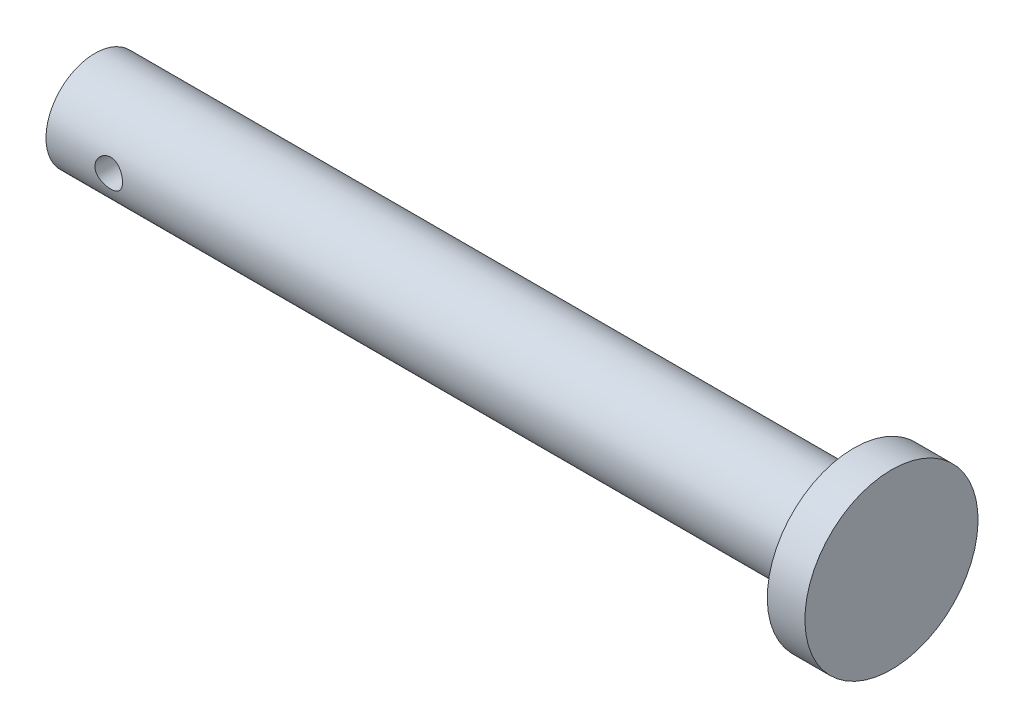
ISO-10303-21;
HEADER;
FILE_DESCRIPTION(('STEP AP214'),'2;1');
FILE_NAME('part.step','',(''),(''),'','','');
FILE_SCHEMA(('AUTOMOTIVE_DESIGN { 1 0 10303 214 1 1 1 1 }'));
ENDSEC;
DATA;
#1=APPLICATION_CONTEXT('core data for automotive mechanical design processes');
#2=APPLICATION_PROTOCOL_DEFINITION('international standard','automotive_design',2000,#1);
#3=PRODUCT_CONTEXT('',#1,'mechanical');
#4=PRODUCT('Part','Part','',(#3));
#5=PRODUCT_RELATED_PRODUCT_CATEGORY('part','',(#4));
#6=PRODUCT_DEFINITION_FORMATION('','',#4);
#7=PRODUCT_DEFINITION_CONTEXT('part definition',#1,'design');
#8=PRODUCT_DEFINITION('design','',#6,#7);
#9=PRODUCT_DEFINITION_SHAPE('','',#8);
#10=(LENGTH_UNIT() NAMED_UNIT(*) SI_UNIT(.MILLI.,.METRE.));
#11=(NAMED_UNIT(*) PLANE_ANGLE_UNIT() SI_UNIT($,.RADIAN.));
#12=(NAMED_UNIT(*) SI_UNIT($,.STERADIAN.) SOLID_ANGLE_UNIT());
#13=UNCERTAINTY_MEASURE_WITH_UNIT(LENGTH_MEASURE(1.E-05),#10,'distance_accuracy_value','');
#14=(GEOMETRIC_REPRESENTATION_CONTEXT(3) GLOBAL_UNCERTAINTY_ASSIGNED_CONTEXT((#13)) GLOBAL_UNIT_ASSIGNED_CONTEXT((#10,
#11,#12)) REPRESENTATION_CONTEXT('',''));
#15=CARTESIAN_POINT('',(0.,0.,0.));
#16=DIRECTION('',(0.,0.,1.));
#17=DIRECTION('',(1.,0.,0.));
#18=AXIS2_PLACEMENT_3D('',#15,#16,#17);
#19=CARTESIAN_POINT('',(-30.25,0.,0.));
#20=DIRECTION('',(-1.,0.,0.));
#21=DIRECTION('',(0.,-1.,0.));
#22=AXIS2_PLACEMENT_3D('',#19,#20,#21);
#23=PLANE('',#22);
#24=CARTESIAN_POINT('',(-30.25,0.,0.));
#25=DIRECTION('',(-1.,0.,0.));
#26=DIRECTION('',(0.,-1.,0.));
#27=AXIS2_PLACEMENT_3D('',#24,#25,#26);
#28=CIRCLE('',#27,3.9);
#29=CARTESIAN_POINT('',(-30.25,-3.9,0.));
#30=VERTEX_POINT('',#29);
#31=EDGE_CURVE('E10',#30,#30,#28,.T.);
#32=ORIENTED_EDGE('',*,*,#31,.T.);
#33=EDGE_LOOP('',(#32));
#34=FACE_BOUND('',#33,.T.);
#35=ADVANCED_FACE('F39',(#34),#23,.T.);
#36=CARTESIAN_POINT('',(-30.25,0.,0.));
#37=DIRECTION('',(-1.,0.,0.));
#38=DIRECTION('',(0.,-1.,0.));
#39=AXIS2_PLACEMENT_3D('',#36,#37,#38);
#40=CYLINDRICAL_SURFACE('',#39,3.90000000000001);
#41=CARTESIAN_POINT('',(-24.15,0.,-3.90000000000001));
#42=CARTESIAN_POINT('',(-24.1500011446506,-0.060507677663959,-3.89999923759331));
#43=CARTESIAN_POINT('',(-24.1550091809614,-0.121027207675349,-3.89857817089262));
#44=CARTESIAN_POINT('',(-24.1748681680631,-0.240314295519807,-3.89304761084393));
#45=CARTESIAN_POINT('',(-24.1897230420472,-0.299081145290933,-3.88893704595011));
#46=CARTESIAN_POINT('',(-24.228747893204,-0.413124413709229,-3.87847972162765));
#47=CARTESIAN_POINT('',(-24.2529050737072,-0.468405506473068,-3.87213603520548));
#48=CARTESIAN_POINT('',(-24.3097990785453,-0.574132166045355,-3.85787788472833));
#49=CARTESIAN_POINT('',(-24.3425367378132,-0.624577261628992,-3.84996326783043));
#50=CARTESIAN_POINT('',(-24.4165493633093,-0.720495489383551,-3.83318586879676));
#51=CARTESIAN_POINT('',(-24.4580041407408,-0.765826779919286,-3.82430540167856));
#52=CARTESIAN_POINT('',(-24.5478904124869,-0.848994855477347,-3.80670705325953));
#53=CARTESIAN_POINT('',(-24.5963229207623,-0.88683054938465,-3.79798919579646));
#54=CARTESIAN_POINT('',(-24.6999523529311,-0.954649335201101,-3.78151952450276));
#55=CARTESIAN_POINT('',(-24.7552628197974,-0.984464812299464,-3.77378987777658));
#56=CARTESIAN_POINT('',(-24.8703653238986,-1.03431547732705,-3.76043378140867));
#57=CARTESIAN_POINT('',(-24.9301564215317,-1.05435270920029,-3.75480689228571));
#58=CARTESIAN_POINT('',(-25.0509418590037,-1.08357701362802,-3.74647676669439));
#59=CARTESIAN_POINT('',(-25.111868566696,-1.09302324327858,-3.74370384131684));
#60=CARTESIAN_POINT('',(-25.2345001981028,-1.10160598378415,-3.74118777985535));
#61=CARTESIAN_POINT('',(-25.2962049547194,-1.10074467190281,-3.74144400392356));
#62=CARTESIAN_POINT('',(-25.4165812083371,-1.08894153575081,-3.74489519106187));
#63=CARTESIAN_POINT('',(-25.4752870220617,-1.07831815456131,-3.74799731436534));
#64=CARTESIAN_POINT('',(-25.5900470401316,-1.04780446614765,-3.75664142505417));
#65=CARTESIAN_POINT('',(-25.6461010097549,-1.02791334029358,-3.76218362797201));
#66=CARTESIAN_POINT('',(-25.754773188311,-0.979180637479277,-3.77516164572538));
#67=CARTESIAN_POINT('',(-25.8073402139792,-0.950231201784054,-3.78262007497608));
#68=CARTESIAN_POINT('',(-25.9069798617516,-0.884278747598063,-3.79857859312174));
#69=CARTESIAN_POINT('',(-25.9540512847799,-0.847273976554044,-3.80707890851778));
#70=CARTESIAN_POINT('',(-26.0431772054972,-0.764653930552471,-3.82454545674187));
#71=CARTESIAN_POINT('',(-26.0849843519167,-0.718772609706449,-3.83351734291586));
#72=CARTESIAN_POINT('',(-26.1603648215505,-0.620539251916056,-3.85063802624281));
#73=CARTESIAN_POINT('',(-26.1939377393957,-0.568186896594849,-3.85878678286168));
#74=CARTESIAN_POINT('',(-26.252023819536,-0.458084854554053,-3.87340348483638));
#75=CARTESIAN_POINT('',(-26.2764877092888,-0.400307871774552,-3.87986223428826));
#76=CARTESIAN_POINT('',(-26.3152812545075,-0.281236406478341,-3.89030490679005));
#77=CARTESIAN_POINT('',(-26.3296133969457,-0.21994279116251,-3.89428943714078));
#78=CARTESIAN_POINT('',(-26.3473377869813,-0.0976852146278629,-3.89924098079318));
#79=CARTESIAN_POINT('',(-26.351065833508,-0.0367736120752753,-3.9003005842933));
#80=CARTESIAN_POINT('',(-26.3484097582239,0.0848061175429517,-3.89955152191365));
#81=CARTESIAN_POINT('',(-26.3420268162291,0.145474272187569,-3.89774319068316));
#82=CARTESIAN_POINT('',(-26.3196037831365,0.26361557727822,-3.89152164717875));
#83=CARTESIAN_POINT('',(-26.3037549874128,0.321128007395714,-3.88716006728635));
#84=CARTESIAN_POINT('',(-26.2630758551881,0.432669225515877,-3.87633075403929));
#85=CARTESIAN_POINT('',(-26.2382444916537,0.486697614333567,-3.86986277985578));
#86=CARTESIAN_POINT('',(-26.1797090278618,0.591011016906094,-3.855326243371));
#87=CARTESIAN_POINT('',(-26.1458275349112,0.641192040425683,-3.8472265791004));
#88=CARTESIAN_POINT('',(-26.0703731482623,0.735272712396058,-3.830360593076));
#89=CARTESIAN_POINT('',(-26.0287985499918,0.779170964934014,-3.8215941238313));
#90=CARTESIAN_POINT('',(-25.9375652073209,0.860884201368456,-3.80403509333685));
#91=CARTESIAN_POINT('',(-25.8876913486225,0.898461214543824,-3.795250575218));
#92=CARTESIAN_POINT('',(-25.7821568576523,0.964722934790969,-3.77895201163578));
#93=CARTESIAN_POINT('',(-25.7264964366612,0.993407966377191,-3.77143791981254));
#94=CARTESIAN_POINT('',(-25.6112107458564,1.04086015933842,-3.75861873118578));
#95=CARTESIAN_POINT('',(-25.5516090199924,1.05968111360759,-3.7533016873367));
#96=CARTESIAN_POINT('',(-25.4299082091264,1.08697702395182,-3.74548880571406));
#97=CARTESIAN_POINT('',(-25.3678098624156,1.09545501569938,-3.74299214017187));
#98=CARTESIAN_POINT('',(-25.2453304041269,1.10163498490666,-3.74117752812904));
#99=CARTESIAN_POINT('',(-25.184970116753,1.09972176214845,-3.74174606736604));
#100=CARTESIAN_POINT('',(-25.0654700574066,1.08607783830656,-3.74572881560474));
#101=CARTESIAN_POINT('',(-25.0063302466911,1.0743474493529,-3.74914293413319));
#102=CARTESIAN_POINT('',(-24.8914988146333,1.04163706627277,-3.75836062079829));
#103=CARTESIAN_POINT('',(-24.8357793516843,1.02074772672936,-3.76414073416644));
#104=CARTESIAN_POINT('',(-24.7285923245795,0.970382515204252,-3.77743737399848));
#105=CARTESIAN_POINT('',(-24.677125498757,0.940905156194019,-3.78495420113029));
#106=CARTESIAN_POINT('',(-24.578090604559,0.873073000679086,-3.8011834378826));
#107=CARTESIAN_POINT('',(-24.5307044358443,0.8344600280574,-3.8099268449508));
#108=CARTESIAN_POINT('',(-24.4429593483566,0.749931892147583,-3.827461598856));
#109=CARTESIAN_POINT('',(-24.4026021889913,0.7040149061036,-3.83625295712922));
#110=CARTESIAN_POINT('',(-24.3290706894866,0.604809545059191,-3.85315403559001));
#111=CARTESIAN_POINT('',(-24.2960992168322,0.551366649041525,-3.86124145478805));
#112=CARTESIAN_POINT('',(-24.2396589995387,0.43946846346205,-3.87556963197888));
#113=CARTESIAN_POINT('',(-24.2161848802932,0.381016031586395,-3.88181143387716));
#114=CARTESIAN_POINT('',(-24.1820444179499,0.269087330008014,-3.89105377513521));
#115=CARTESIAN_POINT('',(-24.1700576845462,0.216037444576133,-3.89438272985053));
#116=CARTESIAN_POINT('',(-24.1540354636638,0.108661450619244,-3.89885604666747));
#117=CARTESIAN_POINT('',(-24.1499989721112,0.0543355041311369,-3.9000006846363));
#118=CARTESIAN_POINT('',(-24.15,0.,-3.90000000000001));
#119=B_SPLINE_CURVE_WITH_KNOTS('',3,(#41,#42,#43,#44,#45,#46,#47,#48,#49,#50,#51,#52,#53,#54,
#55,#56,#57,#58,#59,#60,#61,#62,#63,#64,#65,#66,#67,#68,#69,#70,#71,#72,#73,#74,#75,#76,#77,#78,
#79,#80,#81,#82,#83,#84,#85,#86,#87,#88,#89,#90,#91,#92,#93,#94,#95,#96,#97,#98,#99,#100,#101,
#102,#103,#104,#105,#106,#107,#108,#109,#110,#111,#112,#113,#114,#115,#116,#117,#118),
.UNSPECIFIED.,.T.,.F.,(4,2,2,2,2,2,2,2,2,2,2,2,2,2,2,2,2,2,2,2,2,2,2,2,2,2,2,2,2,2,2,2,2,2,2,2,
2,2,4),(0.,0.181323627013893,0.362719540742377,0.543866804469019,0.725031701478567,
0.910383275665114,1.09576181121763,1.28475725614018,1.47371317845514,1.65793702112593,
1.8421219508516,2.02050410473808,2.19890201830106,2.37951062318408,2.56015856139111,
2.74743265533311,2.93471596688698,3.12299810055779,3.31123400180736,3.49343887125421,
3.67562248141676,3.85424332559334,4.03288459907207,4.21532336961537,4.3978026118843,
4.58608738954674,4.77436529491363,4.96160546920793,5.1487906750443,5.32909255981478,
5.50938871222897,5.68793923185574,5.86652068616758,6.05092643817581,6.23537828203814,
6.42440277030185,6.6133201384028,6.77616815368495,6.93899560079675),.UNSPECIFIED.);
#120=CARTESIAN_POINT('',(-24.15,0.,-3.90000000000001));
#121=VERTEX_POINT('',#120);
#122=EDGE_CURVE('E46',#121,#121,#119,.T.);
#123=ORIENTED_EDGE('',*,*,#122,.F.);
#124=EDGE_LOOP('',(#123));
#125=FACE_BOUND('',#124,.T.);
#126=CARTESIAN_POINT('',(-24.15,0.,3.90000000000001));
#127=CARTESIAN_POINT('',(-24.1500011446506,0.0605076776639604,3.89999923759332));
#128=CARTESIAN_POINT('',(-24.1550091809614,0.12102720767535,3.89857817089262));
#129=CARTESIAN_POINT('',(-24.1748681680631,0.240314295519808,3.89304761084393));
#130=CARTESIAN_POINT('',(-24.1897230420472,0.299081145290934,3.88893704595011));
#131=CARTESIAN_POINT('',(-24.228747893204,0.413124413709231,3.87847972162765));
#132=CARTESIAN_POINT('',(-24.2529050737072,0.468405506473071,3.87213603520548));
#133=CARTESIAN_POINT('',(-24.3097990785453,0.574132166045357,3.85787788472833));
#134=CARTESIAN_POINT('',(-24.3425367378132,0.624577261628992,3.84996326783043));
#135=CARTESIAN_POINT('',(-24.4165493633093,0.72049548938355,3.83318586879677));
#136=CARTESIAN_POINT('',(-24.4580041407408,0.765826779919286,3.82430540167856));
#137=CARTESIAN_POINT('',(-24.5478904124869,0.848994855477346,3.80670705325953));
#138=CARTESIAN_POINT('',(-24.5963229207623,0.886830549384648,3.79798919579646));
#139=CARTESIAN_POINT('',(-24.6999523529311,0.954649335201099,3.78151952450277));
#140=CARTESIAN_POINT('',(-24.7552628197974,0.984464812299462,3.77378987777659));
#141=CARTESIAN_POINT('',(-24.8703653238986,1.03431547732705,3.76043378140867));
#142=CARTESIAN_POINT('',(-24.9301564215317,1.05435270920029,3.75480689228571));
#143=CARTESIAN_POINT('',(-25.0509418590037,1.08357701362802,3.74647676669439));
#144=CARTESIAN_POINT('',(-25.111868566696,1.09302324327858,3.74370384131684));
#145=CARTESIAN_POINT('',(-25.2345001981029,1.10160598378415,3.74118777985535));
#146=CARTESIAN_POINT('',(-25.2962049547194,1.10074467190281,3.74144400392356));
#147=CARTESIAN_POINT('',(-25.4165812083371,1.08894153575081,3.74489519106187));
#148=CARTESIAN_POINT('',(-25.4752870220617,1.07831815456131,3.74799731436534));
#149=CARTESIAN_POINT('',(-25.5900470401316,1.04780446614765,3.75664142505417));
#150=CARTESIAN_POINT('',(-25.6461010097549,1.02791334029359,3.76218362797201));
#151=CARTESIAN_POINT('',(-25.754773188311,0.979180637479277,3.77516164572538));
#152=CARTESIAN_POINT('',(-25.8073402139792,0.950231201784054,3.78262007497609));
#153=CARTESIAN_POINT('',(-25.9069798617516,0.884278747598063,3.79857859312174));
#154=CARTESIAN_POINT('',(-25.9540512847799,0.847273976554044,3.80707890851778));
#155=CARTESIAN_POINT('',(-26.0431772054972,0.764653930552471,3.82454545674187));
#156=CARTESIAN_POINT('',(-26.0849843519167,0.718772609706449,3.83351734291586));
#157=CARTESIAN_POINT('',(-26.1603648215505,0.620539251916056,3.85063802624281));
#158=CARTESIAN_POINT('',(-26.1939377393957,0.568186896594849,3.85878678286168));
#159=CARTESIAN_POINT('',(-26.252023819536,0.458084854554053,3.87340348483638));
#160=CARTESIAN_POINT('',(-26.2764877092888,0.400307871774552,3.87986223428826));
#161=CARTESIAN_POINT('',(-26.3152812545075,0.281236406478341,3.89030490679005));
#162=CARTESIAN_POINT('',(-26.3296133969457,0.21994279116251,3.89428943714078));
#163=CARTESIAN_POINT('',(-26.3473377869813,0.097685214627863,3.89924098079318));
#164=CARTESIAN_POINT('',(-26.351065833508,0.0367736120752755,3.9003005842933));
#165=CARTESIAN_POINT('',(-26.3484097582239,-0.0848061175429516,3.89955152191365));
#166=CARTESIAN_POINT('',(-26.3420268162291,-0.145474272187569,3.89774319068316));
#167=CARTESIAN_POINT('',(-26.3196037831365,-0.26361557727822,3.89152164717875));
#168=CARTESIAN_POINT('',(-26.3037549874128,-0.321128007395714,3.88716006728635));
#169=CARTESIAN_POINT('',(-26.2630758551881,-0.432669225515877,3.87633075403929));
#170=CARTESIAN_POINT('',(-26.2382444916537,-0.486697614333566,3.86986277985578));
#171=CARTESIAN_POINT('',(-26.1797090278618,-0.591011016906093,3.855326243371));
#172=CARTESIAN_POINT('',(-26.1458275349112,-0.641192040425682,3.8472265791004));
#173=CARTESIAN_POINT('',(-26.0703731482623,-0.735272712396058,3.830360593076));
#174=CARTESIAN_POINT('',(-26.0287985499918,-0.779170964934014,3.8215941238313));
#175=CARTESIAN_POINT('',(-25.9375652073209,-0.860884201368456,3.80403509333685));
#176=CARTESIAN_POINT('',(-25.8876913486225,-0.898461214543824,3.795250575218));
#177=CARTESIAN_POINT('',(-25.7821568576523,-0.964722934790969,3.77895201163578));
#178=CARTESIAN_POINT('',(-25.7264964366612,-0.993407966377191,3.77143791981254));
#179=CARTESIAN_POINT('',(-25.6112107458564,-1.04086015933842,3.75861873118578));
#180=CARTESIAN_POINT('',(-25.5516090199924,-1.05968111360759,3.7533016873367));
#181=CARTESIAN_POINT('',(-25.4299082091264,-1.08697702395182,3.74548880571406));
#182=CARTESIAN_POINT('',(-25.3678098624156,-1.09545501569938,3.74299214017186));
#183=CARTESIAN_POINT('',(-25.2453304041269,-1.10163498490666,3.74117752812904));
#184=CARTESIAN_POINT('',(-25.184970116753,-1.09972176214845,3.74174606736604));
#185=CARTESIAN_POINT('',(-25.0654700574066,-1.08607783830656,3.74572881560474));
#186=CARTESIAN_POINT('',(-25.0063302466911,-1.0743474493529,3.74914293413319));
#187=CARTESIAN_POINT('',(-24.8914988146333,-1.04163706627277,3.75836062079829));
#188=CARTESIAN_POINT('',(-24.8357793516843,-1.02074772672936,3.76414073416644));
#189=CARTESIAN_POINT('',(-24.7285923245795,-0.970382515204252,3.77743737399848));
#190=CARTESIAN_POINT('',(-24.677125498757,-0.940905156194019,3.78495420113029));
#191=CARTESIAN_POINT('',(-24.578090604559,-0.873073000679086,3.8011834378826));
#192=CARTESIAN_POINT('',(-24.5307044358443,-0.8344600280574,3.8099268449508));
#193=CARTESIAN_POINT('',(-24.4429593483566,-0.749931892147583,3.827461598856));
#194=CARTESIAN_POINT('',(-24.4026021889913,-0.704014906103599,3.83625295712922));
#195=CARTESIAN_POINT('',(-24.3290706894866,-0.604809545059191,3.85315403559001));
#196=CARTESIAN_POINT('',(-24.2960992168322,-0.551366649041525,3.86124145478805));
#197=CARTESIAN_POINT('',(-24.2396589995387,-0.439468463462051,3.87556963197888));
#198=CARTESIAN_POINT('',(-24.2161848802932,-0.381016031586395,3.88181143387716));
#199=CARTESIAN_POINT('',(-24.1820444179499,-0.269087330008013,3.89105377513521));
#200=CARTESIAN_POINT('',(-24.1700576845462,-0.216037444576132,3.89438272985052));
#201=CARTESIAN_POINT('',(-24.1540354636638,-0.108661450619242,3.89885604666747));
#202=CARTESIAN_POINT('',(-24.1499989721112,-0.0543355041311352,3.9000006846363));
#203=CARTESIAN_POINT('',(-24.15,0.,3.90000000000001));
#204=B_SPLINE_CURVE_WITH_KNOTS('',3,(#126,#127,#128,#129,#130,#131,#132,#133,#134,#135,#136,
#137,#138,#139,#140,#141,#142,#143,#144,#145,#146,#147,#148,#149,#150,#151,#152,#153,#154,#155,
#156,#157,#158,#159,#160,#161,#162,#163,#164,#165,#166,#167,#168,#169,#170,#171,#172,#173,#174,
#175,#176,#177,#178,#179,#180,#181,#182,#183,#184,#185,#186,#187,#188,#189,#190,#191,#192,#193,
#194,#195,#196,#197,#198,#199,#200,#201,#202,#203),.UNSPECIFIED.,.T.,.F.,(4,2,2,2,2,2,2,2,2,2,2,
2,2,2,2,2,2,2,2,2,2,2,2,2,2,2,2,2,2,2,2,2,2,2,2,2,2,2,4),(0.,0.181323627013892,
0.362719540742376,0.543866804469022,0.725031701478565,0.910383275665111,1.09576181121763,
1.28475725614017,1.47371317845513,1.65793702112593,1.8421219508516,2.02050410473807,
2.19890201830106,2.37951062318408,2.56015856139111,2.74743265533311,2.93471596688698,
3.12299810055779,3.31123400180735,3.49343887125421,3.67562248141676,3.85424332559334,
4.03288459907207,4.21532336961537,4.39780261188429,4.58608738954673,4.77436529491363,
4.96160546920793,5.1487906750443,5.32909255981478,5.50938871222897,5.68793923185574,
5.86652068616758,6.05092643817581,6.23537828203814,6.42440277030185,6.6133201384028,
6.77616815368495,6.93899560079675),.UNSPECIFIED.);
#205=CARTESIAN_POINT('',(-24.15,0.,3.90000000000001));
#206=VERTEX_POINT('',#205);
#207=EDGE_CURVE('E51',#206,#206,#204,.T.);
#208=ORIENTED_EDGE('',*,*,#207,.F.);
#209=EDGE_LOOP('',(#208));
#210=FACE_BOUND('',#209,.T.);
#211=CARTESIAN_POINT('',(30.25,0.,0.));
#212=DIRECTION('',(-1.,0.,0.));
#213=DIRECTION('',(0.,-1.,0.));
#214=AXIS2_PLACEMENT_3D('',#211,#212,#213);
#215=CIRCLE('',#214,3.90000000000001);
#216=CARTESIAN_POINT('',(30.25,-3.89999999999999,0.));
#217=VERTEX_POINT('',#216);
#218=EDGE_CURVE('E57',#217,#217,#215,.T.);
#219=ORIENTED_EDGE('',*,*,#218,.T.);
#220=EDGE_LOOP('',(#219));
#221=FACE_BOUND('',#220,.T.);
#222=ORIENTED_EDGE('',*,*,#31,.F.);
#223=EDGE_LOOP('',(#222));
#224=FACE_BOUND('',#223,.T.);
#225=ADVANCED_FACE('F67',(#125,#210,#221,#224),#40,.T.);
#226=CARTESIAN_POINT('',(-25.25,0.,-3.90000000000001));
#227=DIRECTION('',(0.,0.,1.));
#228=DIRECTION('',(1.,0.,0.));
#229=AXIS2_PLACEMENT_3D('',#226,#227,#228);
#230=CYLINDRICAL_SURFACE('',#229,1.1);
#231=ORIENTED_EDGE('',*,*,#122,.T.);
#232=EDGE_LOOP('',(#231));
#233=FACE_BOUND('',#232,.T.);
#234=ORIENTED_EDGE('',*,*,#207,.T.);
#235=EDGE_LOOP('',(#234));
#236=FACE_BOUND('',#235,.T.);
#237=ADVANCED_FACE('F69',(#233,#236),#230,.F.);
#238=CARTESIAN_POINT('',(33.25,0.,0.));
#239=DIRECTION('',(-1.,0.,0.));
#240=DIRECTION('',(0.,-1.,0.));
#241=AXIS2_PLACEMENT_3D('',#238,#239,#240);
#242=CYLINDRICAL_SURFACE('',#241,6.90000000000001);
#243=CARTESIAN_POINT('',(33.25,0.,0.));
#244=DIRECTION('',(1.,0.,0.));
#245=DIRECTION('',(0.,1.,0.));
#246=AXIS2_PLACEMENT_3D('',#243,#244,#245);
#247=CIRCLE('',#246,6.90000000000001);
#248=CARTESIAN_POINT('',(33.25,6.90000000000003,0.));
#249=VERTEX_POINT('',#248);
#250=EDGE_CURVE('E102',#249,#249,#247,.T.);
#251=ORIENTED_EDGE('',*,*,#250,.F.);
#252=EDGE_LOOP('',(#251));
#253=FACE_BOUND('',#252,.T.);
#254=CARTESIAN_POINT('',(30.25,0.,0.));
#255=DIRECTION('',(1.,0.,0.));
#256=DIRECTION('',(0.,1.,0.));
#257=AXIS2_PLACEMENT_3D('',#254,#255,#256);
#258=CIRCLE('',#257,6.90000000000001);
#259=CARTESIAN_POINT('',(30.25,6.90000000000003,0.));
#260=VERTEX_POINT('',#259);
#261=EDGE_CURVE('E104',#260,#260,#258,.T.);
#262=ORIENTED_EDGE('',*,*,#261,.T.);
#263=EDGE_LOOP('',(#262));
#264=FACE_BOUND('',#263,.T.);
#265=ADVANCED_FACE('F73',(#253,#264),#242,.T.);
#266=CARTESIAN_POINT('',(33.25,0.,0.));
#267=DIRECTION('',(1.,0.,0.));
#268=DIRECTION('',(0.,1.,0.));
#269=AXIS2_PLACEMENT_3D('',#266,#267,#268);
#270=PLANE('',#269);
#271=ORIENTED_EDGE('',*,*,#250,.T.);
#272=EDGE_LOOP('',(#271));
#273=FACE_BOUND('',#272,.T.);
#274=ADVANCED_FACE('F77',(#273),#270,.T.);
#275=CARTESIAN_POINT('',(30.25,0.,0.));
#276=DIRECTION('',(1.,0.,0.));
#277=DIRECTION('',(0.,1.,0.));
#278=AXIS2_PLACEMENT_3D('',#275,#276,#277);
#279=PLANE('',#278);
#280=ORIENTED_EDGE('',*,*,#218,.F.);
#281=EDGE_LOOP('',(#280));
#282=FACE_BOUND('',#281,.T.);
#283=ORIENTED_EDGE('',*,*,#261,.F.);
#284=EDGE_LOOP('',(#283));
#285=FACE_BOUND('',#284,.T.);
#286=ADVANCED_FACE('F79',(#282,#285),#279,.F.);
#287=CLOSED_SHELL('',(#35,#225,#237,#265,#274,#286));
#288=MANIFOLD_SOLID_BREP('B2',#287);
#289=ADVANCED_BREP_SHAPE_REPRESENTATION('',(#18,#288),#14);
#290=SHAPE_DEFINITION_REPRESENTATION(#9,#289);
ENDSEC;
END-ISO-10303-21;
